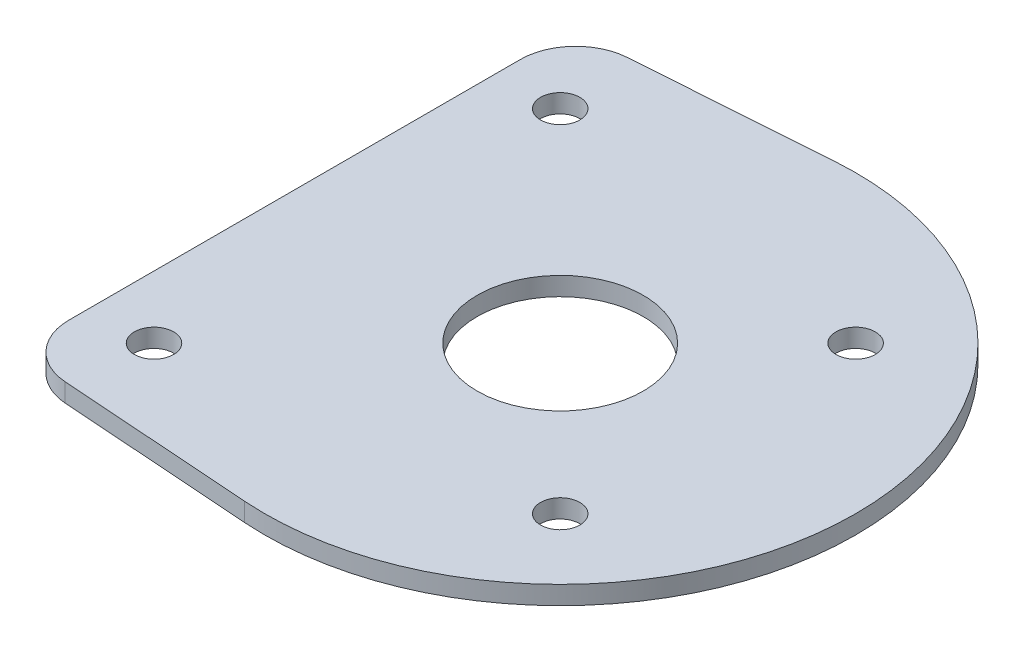
ISO-10303-21;
HEADER;
FILE_DESCRIPTION(('STEP AP214'),'2;1');
FILE_NAME('part.step','',(''),(''),'','','');
FILE_SCHEMA(('AUTOMOTIVE_DESIGN { 1 0 10303 214 1 1 1 1 }'));
ENDSEC;
DATA;
#1=APPLICATION_CONTEXT('core data for automotive mechanical design processes');
#2=APPLICATION_PROTOCOL_DEFINITION('international standard','automotive_design',2000,#1);
#3=PRODUCT_CONTEXT('',#1,'mechanical');
#4=PRODUCT('Part','Part','',(#3));
#5=PRODUCT_RELATED_PRODUCT_CATEGORY('part','',(#4));
#6=PRODUCT_DEFINITION_FORMATION('','',#4);
#7=PRODUCT_DEFINITION_CONTEXT('part definition',#1,'design');
#8=PRODUCT_DEFINITION('design','',#6,#7);
#9=PRODUCT_DEFINITION_SHAPE('','',#8);
#10=(LENGTH_UNIT() NAMED_UNIT(*) SI_UNIT(.MILLI.,.METRE.));
#11=(NAMED_UNIT(*) PLANE_ANGLE_UNIT() SI_UNIT($,.RADIAN.));
#12=(NAMED_UNIT(*) SI_UNIT($,.STERADIAN.) SOLID_ANGLE_UNIT());
#13=UNCERTAINTY_MEASURE_WITH_UNIT(LENGTH_MEASURE(1.E-05),#10,'distance_accuracy_value','');
#14=(GEOMETRIC_REPRESENTATION_CONTEXT(3) GLOBAL_UNCERTAINTY_ASSIGNED_CONTEXT((#13)) GLOBAL_UNIT_ASSIGNED_CONTEXT((#10,
#11,#12)) REPRESENTATION_CONTEXT('',''));
#15=CARTESIAN_POINT('',(0.,0.,0.));
#16=DIRECTION('',(0.,0.,1.));
#17=DIRECTION('',(1.,0.,0.));
#18=AXIS2_PLACEMENT_3D('',#15,#16,#17);
#19=CARTESIAN_POINT('',(89.48928,3.175,0.));
#20=DIRECTION('',(0.,-1.,0.));
#21=DIRECTION('',(0.,0.,-1.));
#22=AXIS2_PLACEMENT_3D('',#19,#20,#21);
#23=PLANE('',#22);
#24=CARTESIAN_POINT('',(54.56428,3.175,-34.925));
#25=DIRECTION('',(0.,1.,0.));
#26=DIRECTION('',(0.,0.,1.));
#27=AXIS2_PLACEMENT_3D('',#24,#25,#26);
#28=CIRCLE('',#27,3.3782);
#29=CARTESIAN_POINT('',(54.56428,3.175,-31.5468));
#30=VERTEX_POINT('',#29);
#31=EDGE_CURVE('E137',#30,#30,#28,.T.);
#32=ORIENTED_EDGE('',*,*,#31,.F.);
#33=EDGE_LOOP('',(#32));
#34=FACE_BOUND('',#33,.T.);
#35=CARTESIAN_POINT('',(54.56428,3.175,34.925));
#36=DIRECTION('',(0.,1.,0.));
#37=DIRECTION('',(0.,0.,1.));
#38=AXIS2_PLACEMENT_3D('',#35,#36,#37);
#39=CIRCLE('',#38,3.3782);
#40=CARTESIAN_POINT('',(54.56428,3.175,38.3032));
#41=VERTEX_POINT('',#40);
#42=EDGE_CURVE('E155',#41,#41,#39,.T.);
#43=ORIENTED_EDGE('',*,*,#42,.F.);
#44=EDGE_LOOP('',(#43));
#45=FACE_BOUND('',#44,.T.);
#46=CARTESIAN_POINT('',(114.88928,3.175,-25.4));
#47=DIRECTION('',(0.,1.,0.));
#48=DIRECTION('',(0.,0.,1.));
#49=AXIS2_PLACEMENT_3D('',#46,#47,#48);
#50=CIRCLE('',#49,3.3782);
#51=CARTESIAN_POINT('',(114.88928,3.175,-22.0218));
#52=VERTEX_POINT('',#51);
#53=EDGE_CURVE('E161',#52,#52,#50,.T.);
#54=ORIENTED_EDGE('',*,*,#53,.F.);
#55=EDGE_LOOP('',(#54));
#56=FACE_BOUND('',#55,.T.);
#57=CARTESIAN_POINT('',(114.88928,3.175,25.4));
#58=DIRECTION('',(0.,1.,0.));
#59=DIRECTION('',(0.,0.,1.));
#60=AXIS2_PLACEMENT_3D('',#57,#58,#59);
#61=CIRCLE('',#60,3.3782);
#62=CARTESIAN_POINT('',(114.88928,3.175,28.7782));
#63=VERTEX_POINT('',#62);
#64=EDGE_CURVE('E167',#63,#63,#61,.T.);
#65=ORIENTED_EDGE('',*,*,#64,.F.);
#66=EDGE_LOOP('',(#65));
#67=FACE_BOUND('',#66,.T.);
#68=DIRECTION('',(0.,0.,-1.));
#69=VECTOR('',#68,1.);
#70=CARTESIAN_POINT('',(43.8149999999999,3.175,-47.6792199572562));
#71=LINE('',#70,#69);
#72=CARTESIAN_POINT('',(43.815,3.175,38.8077345458046));
#73=VERTEX_POINT('',#72);
#74=CARTESIAN_POINT('',(43.8149999999999,3.175,-38.8077345458046));
#75=VERTEX_POINT('',#74);
#76=EDGE_CURVE('E138',#73,#75,#71,.T.);
#77=ORIENTED_EDGE('',*,*,#76,.F.);
#78=CARTESIAN_POINT('',(53.34,3.175,38.8077345458046));
#79=DIRECTION('',(0.,-1.,0.));
#80=DIRECTION('',(0.,0.,-1.));
#81=AXIS2_PLACEMENT_3D('',#78,#79,#80);
#82=CIRCLE('',#81,9.525);
#83=CARTESIAN_POINT('',(52.6641229564032,3.175,48.308724769036));
#84=VERTEX_POINT('',#83);
#85=EDGE_CURVE('E123',#73,#84,#82,.F.);
#86=ORIENTED_EDGE('',*,*,#85,.T.);
#87=DIRECTION('',(0.997479288528233,0.,0.0709582198001818));
#88=VECTOR('',#87,1.);
#89=CARTESIAN_POINT('',(85.8846024341508,3.175,50.6719478572342));
#90=LINE('',#89,#88);
#91=CARTESIAN_POINT('',(85.8846024341508,3.175,50.6719478572342));
#92=VERTEX_POINT('',#91);
#93=EDGE_CURVE('E97',#84,#92,#90,.T.);
#94=ORIENTED_EDGE('',*,*,#93,.T.);
#95=CARTESIAN_POINT('',(89.48928,3.175,0.));
#96=DIRECTION('',(0.,1.,0.));
#97=DIRECTION('',(0.,0.,-1.));
#98=AXIS2_PLACEMENT_3D('',#95,#96,#97);
#99=CIRCLE('',#98,50.8);
#100=CARTESIAN_POINT('',(85.8846024341508,3.175,-50.6719478572342));
#101=VERTEX_POINT('',#100);
#102=EDGE_CURVE('E98',#92,#101,#99,.T.);
#103=ORIENTED_EDGE('',*,*,#102,.T.);
#104=DIRECTION('',(-0.997479288528233,0.,0.0709582198001818));
#105=VECTOR('',#104,1.);
#106=CARTESIAN_POINT('',(85.8846024341508,3.175,-50.6719478572342));
#107=LINE('',#106,#105);
#108=CARTESIAN_POINT('',(52.6641229564032,3.175,-48.308724769036));
#109=VERTEX_POINT('',#108);
#110=EDGE_CURVE('E89',#101,#109,#107,.T.);
#111=ORIENTED_EDGE('',*,*,#110,.T.);
#112=CARTESIAN_POINT('',(53.3399999999999,3.175,-38.8077345458046));
#113=DIRECTION('',(0.,-1.,0.));
#114=DIRECTION('',(0.,0.,-1.));
#115=AXIS2_PLACEMENT_3D('',#112,#113,#114);
#116=CIRCLE('',#115,9.525);
#117=EDGE_CURVE('E121',#109,#75,#116,.F.);
#118=ORIENTED_EDGE('',*,*,#117,.T.);
#119=EDGE_LOOP('',(#77,#86,#94,#103,#111,#118));
#120=FACE_BOUND('',#119,.T.);
#121=CARTESIAN_POINT('',(89.48928,3.175,0.));
#122=DIRECTION('',(0.,1.,0.));
#123=DIRECTION('',(0.,0.,1.));
#124=AXIS2_PLACEMENT_3D('',#121,#122,#123);
#125=CIRCLE('',#124,14.28115);
#126=CARTESIAN_POINT('',(89.48928,3.175,14.28115));
#127=VERTEX_POINT('',#126);
#128=EDGE_CURVE('E146',#127,#127,#125,.T.);
#129=ORIENTED_EDGE('',*,*,#128,.F.);
#130=EDGE_LOOP('',(#129));
#131=FACE_BOUND('',#130,.T.);
#132=ADVANCED_FACE('F34',(#34,#45,#56,#67,#120,#131),#23,.F.);
#133=CARTESIAN_POINT('',(89.48928,0.,0.));
#134=DIRECTION('',(0.,-1.,0.));
#135=DIRECTION('',(0.,0.,-1.));
#136=AXIS2_PLACEMENT_3D('',#133,#134,#135);
#137=PLANE('',#136);
#138=DIRECTION('',(0.997479288528233,0.,0.0709582198001818));
#139=VECTOR('',#138,1.);
#140=CARTESIAN_POINT('',(85.8846024341508,0.,50.6719478572342));
#141=LINE('',#140,#139);
#142=CARTESIAN_POINT('',(52.6641229564032,0.,48.308724769036));
#143=VERTEX_POINT('',#142);
#144=CARTESIAN_POINT('',(85.8846024341508,0.,50.6719478572342));
#145=VERTEX_POINT('',#144);
#146=EDGE_CURVE('E106',#143,#145,#141,.T.);
#147=ORIENTED_EDGE('',*,*,#146,.F.);
#148=CARTESIAN_POINT('',(53.34,0.,38.8077345458046));
#149=DIRECTION('',(0.,-1.,0.));
#150=DIRECTION('',(0.,0.,-1.));
#151=AXIS2_PLACEMENT_3D('',#148,#149,#150);
#152=CIRCLE('',#151,9.525);
#153=CARTESIAN_POINT('',(43.815,0.,38.8077345458046));
#154=VERTEX_POINT('',#153);
#155=EDGE_CURVE('E42',#143,#154,#152,.T.);
#156=ORIENTED_EDGE('',*,*,#155,.T.);
#157=DIRECTION('',(0.,0.,-1.));
#158=VECTOR('',#157,1.);
#159=CARTESIAN_POINT('',(43.8149999999999,0.,-47.6792199572562));
#160=LINE('',#159,#158);
#161=CARTESIAN_POINT('',(43.8149999999999,0.,-38.8077345458046));
#162=VERTEX_POINT('',#161);
#163=EDGE_CURVE('E130',#154,#162,#160,.T.);
#164=ORIENTED_EDGE('',*,*,#163,.T.);
#165=CARTESIAN_POINT('',(53.3399999999999,0.,-38.8077345458046));
#166=DIRECTION('',(0.,-1.,0.));
#167=DIRECTION('',(0.,0.,-1.));
#168=AXIS2_PLACEMENT_3D('',#165,#166,#167);
#169=CIRCLE('',#168,9.525);
#170=CARTESIAN_POINT('',(52.6641229564032,0.,-48.308724769036));
#171=VERTEX_POINT('',#170);
#172=EDGE_CURVE('E49',#162,#171,#169,.T.);
#173=ORIENTED_EDGE('',*,*,#172,.T.);
#174=DIRECTION('',(-0.997479288528233,0.,0.0709582198001818));
#175=VECTOR('',#174,1.);
#176=CARTESIAN_POINT('',(85.8846024341508,0.,-50.6719478572342));
#177=LINE('',#176,#175);
#178=CARTESIAN_POINT('',(85.8846024341508,0.,-50.6719478572342));
#179=VERTEX_POINT('',#178);
#180=EDGE_CURVE('E145',#179,#171,#177,.T.);
#181=ORIENTED_EDGE('',*,*,#180,.F.);
#182=CARTESIAN_POINT('',(89.48928,0.,0.));
#183=DIRECTION('',(0.,1.,0.));
#184=DIRECTION('',(0.,0.,-1.));
#185=AXIS2_PLACEMENT_3D('',#182,#183,#184);
#186=CIRCLE('',#185,50.8);
#187=EDGE_CURVE('E110',#145,#179,#186,.T.);
#188=ORIENTED_EDGE('',*,*,#187,.F.);
#189=EDGE_LOOP('',(#147,#156,#164,#173,#181,#188));
#190=FACE_BOUND('',#189,.T.);
#191=CARTESIAN_POINT('',(54.56428,0.,-34.925));
#192=DIRECTION('',(0.,1.,0.));
#193=DIRECTION('',(0.,0.,1.));
#194=AXIS2_PLACEMENT_3D('',#191,#192,#193);
#195=CIRCLE('',#194,3.3782);
#196=CARTESIAN_POINT('',(54.56428,0.,-31.5468));
#197=VERTEX_POINT('',#196);
#198=EDGE_CURVE('E152',#197,#197,#195,.T.);
#199=ORIENTED_EDGE('',*,*,#198,.T.);
#200=EDGE_LOOP('',(#199));
#201=FACE_BOUND('',#200,.T.);
#202=CARTESIAN_POINT('',(54.56428,0.,34.925));
#203=DIRECTION('',(0.,1.,0.));
#204=DIRECTION('',(0.,0.,1.));
#205=AXIS2_PLACEMENT_3D('',#202,#203,#204);
#206=CIRCLE('',#205,3.3782);
#207=CARTESIAN_POINT('',(54.56428,0.,38.3032));
#208=VERTEX_POINT('',#207);
#209=EDGE_CURVE('E158',#208,#208,#206,.T.);
#210=ORIENTED_EDGE('',*,*,#209,.T.);
#211=EDGE_LOOP('',(#210));
#212=FACE_BOUND('',#211,.T.);
#213=CARTESIAN_POINT('',(114.88928,0.,-25.4));
#214=DIRECTION('',(0.,1.,0.));
#215=DIRECTION('',(0.,0.,1.));
#216=AXIS2_PLACEMENT_3D('',#213,#214,#215);
#217=CIRCLE('',#216,3.3782);
#218=CARTESIAN_POINT('',(114.88928,0.,-22.0218));
#219=VERTEX_POINT('',#218);
#220=EDGE_CURVE('E164',#219,#219,#217,.T.);
#221=ORIENTED_EDGE('',*,*,#220,.T.);
#222=EDGE_LOOP('',(#221));
#223=FACE_BOUND('',#222,.T.);
#224=CARTESIAN_POINT('',(114.88928,0.,25.4));
#225=DIRECTION('',(0.,1.,0.));
#226=DIRECTION('',(0.,0.,1.));
#227=AXIS2_PLACEMENT_3D('',#224,#225,#226);
#228=CIRCLE('',#227,3.3782);
#229=CARTESIAN_POINT('',(114.88928,0.,28.7782));
#230=VERTEX_POINT('',#229);
#231=EDGE_CURVE('E170',#230,#230,#228,.T.);
#232=ORIENTED_EDGE('',*,*,#231,.T.);
#233=EDGE_LOOP('',(#232));
#234=FACE_BOUND('',#233,.T.);
#235=CARTESIAN_POINT('',(89.48928,0.,0.));
#236=DIRECTION('',(0.,1.,0.));
#237=DIRECTION('',(0.,0.,1.));
#238=AXIS2_PLACEMENT_3D('',#235,#236,#237);
#239=CIRCLE('',#238,14.28115);
#240=CARTESIAN_POINT('',(89.48928,0.,14.28115));
#241=VERTEX_POINT('',#240);
#242=EDGE_CURVE('E173',#241,#241,#239,.T.);
#243=ORIENTED_EDGE('',*,*,#242,.T.);
#244=EDGE_LOOP('',(#243));
#245=FACE_BOUND('',#244,.T.);
#246=ADVANCED_FACE('F128',(#190,#201,#212,#223,#234,#245),#137,.T.);
#247=CARTESIAN_POINT('',(89.48928,3.175,0.));
#248=DIRECTION('',(0.,-1.,0.));
#249=DIRECTION('',(0.,0.,-1.));
#250=AXIS2_PLACEMENT_3D('',#247,#248,#249);
#251=CYLINDRICAL_SURFACE('',#250,50.8);
#252=ORIENTED_EDGE('',*,*,#187,.T.);
#253=DIRECTION('',(0.,-1.,0.));
#254=VECTOR('',#253,1.);
#255=CARTESIAN_POINT('',(85.8846024341508,3.175,-50.6719478572342));
#256=LINE('',#255,#254);
#257=EDGE_CURVE('E93',#101,#179,#256,.T.);
#258=ORIENTED_EDGE('',*,*,#257,.F.);
#259=ORIENTED_EDGE('',*,*,#102,.F.);
#260=DIRECTION('',(0.,-1.,0.));
#261=VECTOR('',#260,1.);
#262=CARTESIAN_POINT('',(85.8846024341508,3.175,50.6719478572342));
#263=LINE('',#262,#261);
#264=EDGE_CURVE('E112',#92,#145,#263,.T.);
#265=ORIENTED_EDGE('',*,*,#264,.T.);
#266=EDGE_LOOP('',(#252,#258,#259,#265));
#267=FACE_BOUND('',#266,.T.);
#268=ADVANCED_FACE('F108',(#267),#251,.T.);
#269=CARTESIAN_POINT('',(85.8846024341508,3.175,-50.6719478572342));
#270=DIRECTION('',(0.0709582198001818,0.,0.997479288528233));
#271=DIRECTION('',(0.997479288528233,0.,-0.0709582198001818));
#272=AXIS2_PLACEMENT_3D('',#269,#270,#271);
#273=PLANE('',#272);
#274=ORIENTED_EDGE('',*,*,#180,.T.);
#275=DIRECTION('',(0.,1.,0.));
#276=VECTOR('',#275,1.);
#277=CARTESIAN_POINT('',(52.6641229564032,3.175,-48.308724769036));
#278=LINE('',#277,#276);
#279=EDGE_CURVE('E11',#171,#109,#278,.T.);
#280=ORIENTED_EDGE('',*,*,#279,.T.);
#281=ORIENTED_EDGE('',*,*,#110,.F.);
#282=ORIENTED_EDGE('',*,*,#257,.T.);
#283=EDGE_LOOP('',(#274,#280,#281,#282));
#284=FACE_BOUND('',#283,.T.);
#285=ADVANCED_FACE('F91',(#284),#273,.F.);
#286=CARTESIAN_POINT('',(85.8846024341508,3.175,50.6719478572342));
#287=DIRECTION('',(0.0709582198001818,0.,-0.997479288528233));
#288=DIRECTION('',(-0.997479288528233,0.,-0.0709582198001818));
#289=AXIS2_PLACEMENT_3D('',#286,#287,#288);
#290=PLANE('',#289);
#291=ORIENTED_EDGE('',*,*,#93,.F.);
#292=DIRECTION('',(0.,1.,0.));
#293=VECTOR('',#292,1.);
#294=CARTESIAN_POINT('',(52.6641229564033,3.175,48.308724769036));
#295=LINE('',#294,#293);
#296=EDGE_CURVE('E57',#84,#143,#295,.F.);
#297=ORIENTED_EDGE('',*,*,#296,.T.);
#298=ORIENTED_EDGE('',*,*,#146,.T.);
#299=ORIENTED_EDGE('',*,*,#264,.F.);
#300=EDGE_LOOP('',(#291,#297,#298,#299));
#301=FACE_BOUND('',#300,.T.);
#302=ADVANCED_FACE('F141',(#301),#290,.F.);
#303=CARTESIAN_POINT('',(89.48928,3.175,0.));
#304=DIRECTION('',(0.,-1.,0.));
#305=DIRECTION('',(0.,0.,-1.));
#306=AXIS2_PLACEMENT_3D('',#303,#304,#305);
#307=CYLINDRICAL_SURFACE('',#306,14.28115);
#308=ORIENTED_EDGE('',*,*,#128,.T.);
#309=EDGE_LOOP('',(#308));
#310=FACE_BOUND('',#309,.T.);
#311=ORIENTED_EDGE('',*,*,#242,.F.);
#312=EDGE_LOOP('',(#311));
#313=FACE_BOUND('',#312,.T.);
#314=ADVANCED_FACE('F180',(#310,#313),#307,.F.);
#315=CARTESIAN_POINT('',(114.88928,3.175,25.4));
#316=DIRECTION('',(0.,1.,0.));
#317=DIRECTION('',(0.,0.,1.));
#318=AXIS2_PLACEMENT_3D('',#315,#316,#317);
#319=CYLINDRICAL_SURFACE('',#318,3.3782);
#320=ORIENTED_EDGE('',*,*,#231,.F.);
#321=EDGE_LOOP('',(#320));
#322=FACE_BOUND('',#321,.T.);
#323=ORIENTED_EDGE('',*,*,#64,.T.);
#324=EDGE_LOOP('',(#323));
#325=FACE_BOUND('',#324,.T.);
#326=ADVANCED_FACE('F182',(#322,#325),#319,.F.);
#327=CARTESIAN_POINT('',(114.88928,3.175,-25.4));
#328=DIRECTION('',(0.,1.,0.));
#329=DIRECTION('',(0.,0.,1.));
#330=AXIS2_PLACEMENT_3D('',#327,#328,#329);
#331=CYLINDRICAL_SURFACE('',#330,3.3782);
#332=ORIENTED_EDGE('',*,*,#220,.F.);
#333=EDGE_LOOP('',(#332));
#334=FACE_BOUND('',#333,.T.);
#335=ORIENTED_EDGE('',*,*,#53,.T.);
#336=EDGE_LOOP('',(#335));
#337=FACE_BOUND('',#336,.T.);
#338=ADVANCED_FACE('F189',(#334,#337),#331,.F.);
#339=CARTESIAN_POINT('',(54.56428,3.175,34.925));
#340=DIRECTION('',(0.,1.,0.));
#341=DIRECTION('',(0.,0.,1.));
#342=AXIS2_PLACEMENT_3D('',#339,#340,#341);
#343=CYLINDRICAL_SURFACE('',#342,3.3782);
#344=ORIENTED_EDGE('',*,*,#209,.F.);
#345=EDGE_LOOP('',(#344));
#346=FACE_BOUND('',#345,.T.);
#347=ORIENTED_EDGE('',*,*,#42,.T.);
#348=EDGE_LOOP('',(#347));
#349=FACE_BOUND('',#348,.T.);
#350=ADVANCED_FACE('F216',(#346,#349),#343,.F.);
#351=CARTESIAN_POINT('',(54.56428,3.175,-34.925));
#352=DIRECTION('',(0.,1.,0.));
#353=DIRECTION('',(0.,0.,1.));
#354=AXIS2_PLACEMENT_3D('',#351,#352,#353);
#355=CYLINDRICAL_SURFACE('',#354,3.3782);
#356=ORIENTED_EDGE('',*,*,#198,.F.);
#357=EDGE_LOOP('',(#356));
#358=FACE_BOUND('',#357,.T.);
#359=ORIENTED_EDGE('',*,*,#31,.T.);
#360=EDGE_LOOP('',(#359));
#361=FACE_BOUND('',#360,.T.);
#362=ADVANCED_FACE('F211',(#358,#361),#355,.F.);
#363=CARTESIAN_POINT('',(43.8149999999999,0.,-47.6792199572562));
#364=DIRECTION('',(1.,0.,0.));
#365=DIRECTION('',(0.,0.,-1.));
#366=AXIS2_PLACEMENT_3D('',#363,#364,#365);
#367=PLANE('',#366);
#368=ORIENTED_EDGE('',*,*,#163,.F.);
#369=DIRECTION('',(0.,1.,0.));
#370=VECTOR('',#369,1.);
#371=CARTESIAN_POINT('',(43.815,0.,38.8077345458046));
#372=LINE('',#371,#370);
#373=EDGE_CURVE('E114',#154,#73,#372,.T.);
#374=ORIENTED_EDGE('',*,*,#373,.T.);
#375=ORIENTED_EDGE('',*,*,#76,.T.);
#376=DIRECTION('',(0.,1.,0.));
#377=VECTOR('',#376,1.);
#378=CARTESIAN_POINT('',(43.8149999999999,0.,-38.8077345458046));
#379=LINE('',#378,#377);
#380=EDGE_CURVE('E111',#75,#162,#379,.F.);
#381=ORIENTED_EDGE('',*,*,#380,.T.);
#382=EDGE_LOOP('',(#368,#374,#375,#381));
#383=FACE_BOUND('',#382,.T.);
#384=ADVANCED_FACE('F134',(#383),#367,.F.);
#385=CARTESIAN_POINT('',(53.34,0.,38.8077345458046));
#386=DIRECTION('',(0.,1.,0.));
#387=DIRECTION('',(0.,0.,1.));
#388=AXIS2_PLACEMENT_3D('',#385,#386,#387);
#389=CYLINDRICAL_SURFACE('',#388,9.525);
#390=ORIENTED_EDGE('',*,*,#155,.F.);
#391=ORIENTED_EDGE('',*,*,#296,.F.);
#392=ORIENTED_EDGE('',*,*,#85,.F.);
#393=ORIENTED_EDGE('',*,*,#373,.F.);
#394=EDGE_LOOP('',(#390,#391,#392,#393));
#395=FACE_BOUND('',#394,.T.);
#396=ADVANCED_FACE('F140',(#395),#389,.T.);
#397=CARTESIAN_POINT('',(53.3399999999999,3.175,-38.8077345458046));
#398=DIRECTION('',(0.,1.,0.));
#399=DIRECTION('',(0.,0.,1.));
#400=AXIS2_PLACEMENT_3D('',#397,#398,#399);
#401=CYLINDRICAL_SURFACE('',#400,9.525);
#402=ORIENTED_EDGE('',*,*,#172,.F.);
#403=ORIENTED_EDGE('',*,*,#380,.F.);
#404=ORIENTED_EDGE('',*,*,#117,.F.);
#405=ORIENTED_EDGE('',*,*,#279,.F.);
#406=EDGE_LOOP('',(#402,#403,#404,#405));
#407=FACE_BOUND('',#406,.T.);
#408=ADVANCED_FACE('F36',(#407),#401,.T.);
#409=CLOSED_SHELL('',(#132,#246,#268,#285,#302,#314,#326,#338,#350,#362,#384,#396,#408));
#410=MANIFOLD_SOLID_BREP('B2',#409);
#411=ADVANCED_BREP_SHAPE_REPRESENTATION('',(#18,#410),#14);
#412=SHAPE_DEFINITION_REPRESENTATION(#9,#411);
ENDSEC;
END-ISO-10303-21;
